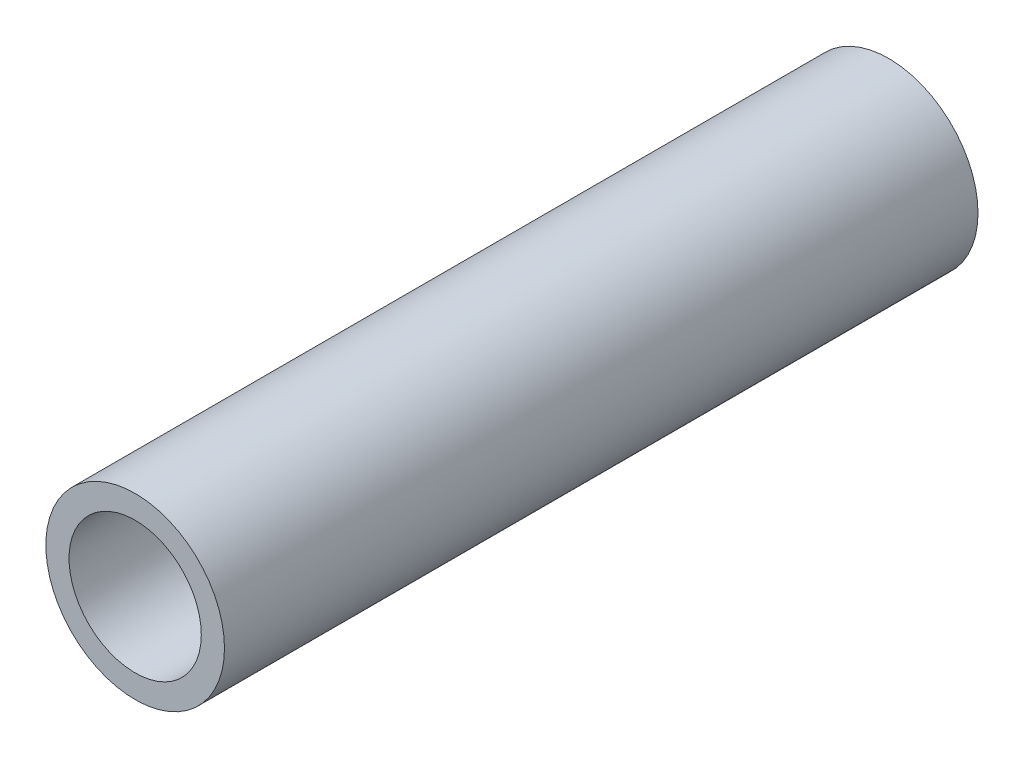
ISO-10303-21;
HEADER;
FILE_DESCRIPTION(('STEP AP214'),'2;1');
FILE_NAME('part.step','',(''),(''),'','','');
FILE_SCHEMA(('AUTOMOTIVE_DESIGN { 1 0 10303 214 1 1 1 1 }'));
ENDSEC;
DATA;
#1=APPLICATION_CONTEXT('core data for automotive mechanical design processes');
#2=APPLICATION_PROTOCOL_DEFINITION('international standard','automotive_design',2000,#1);
#3=PRODUCT_CONTEXT('',#1,'mechanical');
#4=PRODUCT('Part','Part','',(#3));
#5=PRODUCT_RELATED_PRODUCT_CATEGORY('part','',(#4));
#6=PRODUCT_DEFINITION_FORMATION('','',#4);
#7=PRODUCT_DEFINITION_CONTEXT('part definition',#1,'design');
#8=PRODUCT_DEFINITION('design','',#6,#7);
#9=PRODUCT_DEFINITION_SHAPE('','',#8);
#10=(LENGTH_UNIT() NAMED_UNIT(*) SI_UNIT(.MILLI.,.METRE.));
#11=(NAMED_UNIT(*) PLANE_ANGLE_UNIT() SI_UNIT($,.RADIAN.));
#12=(NAMED_UNIT(*) SI_UNIT($,.STERADIAN.) SOLID_ANGLE_UNIT());
#13=UNCERTAINTY_MEASURE_WITH_UNIT(LENGTH_MEASURE(1.E-05),#10,'distance_accuracy_value','');
#14=(GEOMETRIC_REPRESENTATION_CONTEXT(3) GLOBAL_UNCERTAINTY_ASSIGNED_CONTEXT((#13)) GLOBAL_UNIT_ASSIGNED_CONTEXT((#10,
#11,#12)) REPRESENTATION_CONTEXT('',''));
#15=CARTESIAN_POINT('',(0.,0.,0.));
#16=DIRECTION('',(0.,0.,1.));
#17=DIRECTION('',(1.,0.,0.));
#18=AXIS2_PLACEMENT_3D('',#15,#16,#17);
#19=CARTESIAN_POINT('',(0.,0.,45.));
#20=DIRECTION('',(0.,0.,1.));
#21=DIRECTION('',(1.,0.,0.));
#22=AXIS2_PLACEMENT_3D('',#19,#20,#21);
#23=PLANE('',#22);
#24=CARTESIAN_POINT('',(0.,0.,45.));
#25=DIRECTION('',(0.,0.,1.));
#26=DIRECTION('',(1.,0.,0.));
#27=AXIS2_PLACEMENT_3D('',#24,#25,#26);
#28=CIRCLE('',#27,10.668);
#29=CARTESIAN_POINT('',(10.668,0.,45.));
#30=VERTEX_POINT('',#29);
#31=EDGE_CURVE('E11',#30,#30,#28,.T.);
#32=ORIENTED_EDGE('',*,*,#31,.T.);
#33=EDGE_LOOP('',(#32));
#34=FACE_BOUND('',#33,.T.);
#35=CARTESIAN_POINT('',(0.,0.,45.));
#36=DIRECTION('',(0.,0.,1.));
#37=DIRECTION('',(1.,0.,0.));
#38=AXIS2_PLACEMENT_3D('',#35,#36,#37);
#39=CIRCLE('',#38,7.8994);
#40=CARTESIAN_POINT('',(7.8994,0.,45.));
#41=VERTEX_POINT('',#40);
#42=EDGE_CURVE('E48',#41,#41,#39,.T.);
#43=ORIENTED_EDGE('',*,*,#42,.F.);
#44=EDGE_LOOP('',(#43));
#45=FACE_BOUND('',#44,.T.);
#46=ADVANCED_FACE('F37',(#34,#45),#23,.T.);
#47=CARTESIAN_POINT('',(0.,0.,-45.));
#48=DIRECTION('',(0.,0.,1.));
#49=DIRECTION('',(1.,0.,0.));
#50=AXIS2_PLACEMENT_3D('',#47,#48,#49);
#51=PLANE('',#50);
#52=CARTESIAN_POINT('',(0.,0.,-45.));
#53=DIRECTION('',(0.,0.,1.));
#54=DIRECTION('',(1.,0.,0.));
#55=AXIS2_PLACEMENT_3D('',#52,#53,#54);
#56=CIRCLE('',#55,10.668);
#57=CARTESIAN_POINT('',(10.668,0.,-45.));
#58=VERTEX_POINT('',#57);
#59=EDGE_CURVE('E41',#58,#58,#56,.T.);
#60=ORIENTED_EDGE('',*,*,#59,.F.);
#61=EDGE_LOOP('',(#60));
#62=FACE_BOUND('',#61,.T.);
#63=CARTESIAN_POINT('',(0.,0.,-45.));
#64=DIRECTION('',(0.,0.,1.));
#65=DIRECTION('',(1.,0.,0.));
#66=AXIS2_PLACEMENT_3D('',#63,#64,#65);
#67=CIRCLE('',#66,7.8994);
#68=CARTESIAN_POINT('',(7.8994,0.,-45.));
#69=VERTEX_POINT('',#68);
#70=EDGE_CURVE('E50',#69,#69,#67,.T.);
#71=ORIENTED_EDGE('',*,*,#70,.T.);
#72=EDGE_LOOP('',(#71));
#73=FACE_BOUND('',#72,.T.);
#74=ADVANCED_FACE('F60',(#62,#73),#51,.F.);
#75=CARTESIAN_POINT('',(0.,0.,45.));
#76=DIRECTION('',(0.,0.,-1.));
#77=DIRECTION('',(-1.,0.,0.));
#78=AXIS2_PLACEMENT_3D('',#75,#76,#77);
#79=CYLINDRICAL_SURFACE('',#78,10.668);
#80=ORIENTED_EDGE('',*,*,#31,.F.);
#81=EDGE_LOOP('',(#80));
#82=FACE_BOUND('',#81,.T.);
#83=ORIENTED_EDGE('',*,*,#59,.T.);
#84=EDGE_LOOP('',(#83));
#85=FACE_BOUND('',#84,.T.);
#86=ADVANCED_FACE('F39',(#82,#85),#79,.T.);
#87=CARTESIAN_POINT('',(0.,0.,45.));
#88=DIRECTION('',(0.,0.,-1.));
#89=DIRECTION('',(-1.,0.,0.));
#90=AXIS2_PLACEMENT_3D('',#87,#88,#89);
#91=CYLINDRICAL_SURFACE('',#90,7.8994);
#92=ORIENTED_EDGE('',*,*,#42,.T.);
#93=EDGE_LOOP('',(#92));
#94=FACE_BOUND('',#93,.T.);
#95=ORIENTED_EDGE('',*,*,#70,.F.);
#96=EDGE_LOOP('',(#95));
#97=FACE_BOUND('',#96,.T.);
#98=ADVANCED_FACE('F56',(#94,#97),#91,.F.);
#99=CLOSED_SHELL('',(#46,#74,#86,#98));
#100=MANIFOLD_SOLID_BREP('B2',#99);
#101=ADVANCED_BREP_SHAPE_REPRESENTATION('',(#18,#100),#14);
#102=SHAPE_DEFINITION_REPRESENTATION(#9,#101);
ENDSEC;
END-ISO-10303-21;
